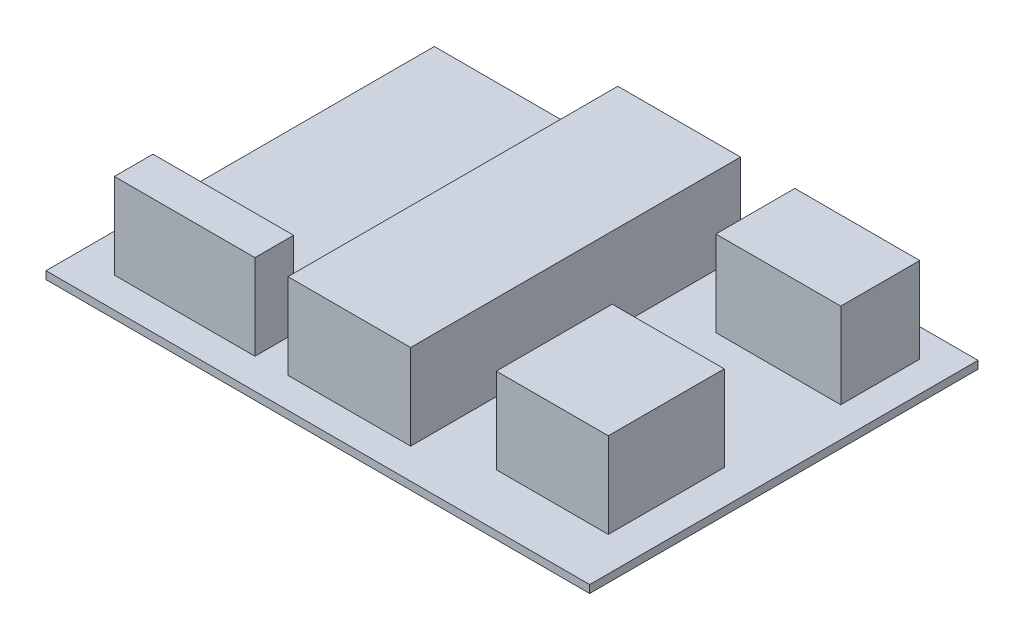
ISO-10303-21;
HEADER;
FILE_DESCRIPTION(('STEP AP214'),'2;1');
FILE_NAME('part.step','',(''),(''),'','','');
FILE_SCHEMA(('AUTOMOTIVE_DESIGN { 1 0 10303 214 1 1 1 1 }'));
ENDSEC;
DATA;
#1=APPLICATION_CONTEXT('core data for automotive mechanical design processes');
#2=APPLICATION_PROTOCOL_DEFINITION('international standard','automotive_design',2000,#1);
#3=PRODUCT_CONTEXT('',#1,'mechanical');
#4=PRODUCT('Part','Part','',(#3));
#5=PRODUCT_RELATED_PRODUCT_CATEGORY('part','',(#4));
#6=PRODUCT_DEFINITION_FORMATION('','',#4);
#7=PRODUCT_DEFINITION_CONTEXT('part definition',#1,'design');
#8=PRODUCT_DEFINITION('design','',#6,#7);
#9=PRODUCT_DEFINITION_SHAPE('','',#8);
#10=(LENGTH_UNIT() NAMED_UNIT(*) SI_UNIT(.MILLI.,.METRE.));
#11=(NAMED_UNIT(*) PLANE_ANGLE_UNIT() SI_UNIT($,.RADIAN.));
#12=(NAMED_UNIT(*) SI_UNIT($,.STERADIAN.) SOLID_ANGLE_UNIT());
#13=UNCERTAINTY_MEASURE_WITH_UNIT(LENGTH_MEASURE(1.E-05),#10,'distance_accuracy_value','');
#14=(GEOMETRIC_REPRESENTATION_CONTEXT(3) GLOBAL_UNCERTAINTY_ASSIGNED_CONTEXT((#13)) GLOBAL_UNIT_ASSIGNED_CONTEXT((#10,
#11,#12)) REPRESENTATION_CONTEXT('',''));
#15=CARTESIAN_POINT('',(0.,0.,0.));
#16=DIRECTION('',(0.,0.,1.));
#17=DIRECTION('',(1.,0.,0.));
#18=AXIS2_PLACEMENT_3D('',#15,#16,#17);
#19=CARTESIAN_POINT('',(0.,1.,0.));
#20=DIRECTION('',(0.,1.,0.));
#21=DIRECTION('',(0.,0.,1.));
#22=AXIS2_PLACEMENT_3D('',#19,#20,#21);
#23=PLANE('',#22);
#24=DIRECTION('',(0.,0.,1.));
#25=VECTOR('',#24,1.);
#26=CARTESIAN_POINT('',(-31.810551558753,1.,-37.6618705035971));
#27=LINE('',#26,#25);
#28=CARTESIAN_POINT('',(-31.810551558753,1.,-37.6618705035971));
#29=VERTEX_POINT('',#28);
#30=CARTESIAN_POINT('',(-31.810551558753,1.,12.3381294964029));
#31=VERTEX_POINT('',#30);
#32=EDGE_CURVE('E305',#29,#31,#27,.T.);
#33=ORIENTED_EDGE('',*,*,#32,.T.);
#34=DIRECTION('',(1.,0.,0.));
#35=VECTOR('',#34,1.);
#36=CARTESIAN_POINT('',(-31.810551558753,1.,12.3381294964029));
#37=LINE('',#36,#35);
#38=CARTESIAN_POINT('',(38.189448441247,1.,12.3381294964029));
#39=VERTEX_POINT('',#38);
#40=EDGE_CURVE('E308',#31,#39,#37,.T.);
#41=ORIENTED_EDGE('',*,*,#40,.T.);
#42=DIRECTION('',(0.,0.,-1.));
#43=VECTOR('',#42,1.);
#44=CARTESIAN_POINT('',(38.189448441247,1.,-37.6618705035971));
#45=LINE('',#44,#43);
#46=CARTESIAN_POINT('',(38.189448441247,1.,-37.6618705035971));
#47=VERTEX_POINT('',#46);
#48=EDGE_CURVE('E311',#39,#47,#45,.T.);
#49=ORIENTED_EDGE('',*,*,#48,.T.);
#50=DIRECTION('',(-1.,0.,0.));
#51=VECTOR('',#50,1.);
#52=CARTESIAN_POINT('',(-31.810551558753,1.,-37.6618705035971));
#53=LINE('',#52,#51);
#54=EDGE_CURVE('E313',#47,#29,#53,.T.);
#55=ORIENTED_EDGE('',*,*,#54,.T.);
#56=EDGE_LOOP('',(#33,#41,#49,#55));
#57=FACE_BOUND('',#56,.T.);
#58=DIRECTION('',(-1.,0.,0.));
#59=VECTOR('',#58,1.);
#60=CARTESIAN_POINT('',(0.,1.,8.43019669865698));
#61=LINE('',#60,#59);
#62=CARTESIAN_POINT('',(11.2296723491148,1.,8.43019669865698));
#63=VERTEX_POINT('',#62);
#64=CARTESIAN_POINT('',(-4.562336940778,1.,8.43019669865698));
#65=VERTEX_POINT('',#64);
#66=EDGE_CURVE('E298',#63,#65,#61,.T.);
#67=ORIENTED_EDGE('',*,*,#66,.T.);
#68=DIRECTION('',(0.,0.,-1.));
#69=VECTOR('',#68,1.);
#70=CARTESIAN_POINT('',(-4.562336940778,1.,0.));
#71=LINE('',#70,#69);
#72=CARTESIAN_POINT('',(-4.562336940778,1.,-34.042376231694));
#73=VERTEX_POINT('',#72);
#74=EDGE_CURVE('E301',#65,#73,#71,.T.);
#75=ORIENTED_EDGE('',*,*,#74,.T.);
#76=DIRECTION('',(1.,0.,0.));
#77=VECTOR('',#76,1.);
#78=CARTESIAN_POINT('',(0.,1.,-34.042376231694));
#79=LINE('',#78,#77);
#80=CARTESIAN_POINT('',(11.2296723491148,1.,-34.042376231694));
#81=VERTEX_POINT('',#80);
#82=EDGE_CURVE('E292',#73,#81,#79,.T.);
#83=ORIENTED_EDGE('',*,*,#82,.T.);
#84=DIRECTION('',(0.,0.,1.));
#85=VECTOR('',#84,1.);
#86=CARTESIAN_POINT('',(11.2296723491148,1.,0.));
#87=LINE('',#86,#85);
#88=EDGE_CURVE('E295',#81,#63,#87,.T.);
#89=ORIENTED_EDGE('',*,*,#88,.T.);
#90=EDGE_LOOP('',(#67,#75,#83,#89));
#91=FACE_BOUND('',#90,.T.);
#92=DIRECTION('',(-1.,0.,0.));
#93=VECTOR('',#92,1.);
#94=CARTESIAN_POINT('',(0.,1.,-23.8749181957356));
#95=LINE('',#94,#93);
#96=CARTESIAN_POINT('',(34.3047544165381,1.,-23.8749181957356));
#97=VERTEX_POINT('',#96);
#98=CARTESIAN_POINT('',(18.2243066008025,1.,-23.8749181957356));
#99=VERTEX_POINT('',#98);
#100=EDGE_CURVE('E266',#97,#99,#95,.T.);
#101=ORIENTED_EDGE('',*,*,#100,.T.);
#102=DIRECTION('',(0.,0.,-1.));
#103=VECTOR('',#102,1.);
#104=CARTESIAN_POINT('',(18.2243066008025,1.,0.));
#105=LINE('',#104,#103);
#106=CARTESIAN_POINT('',(18.2243066008025,1.,-34.042376231694));
#107=VERTEX_POINT('',#106);
#108=EDGE_CURVE('E269',#99,#107,#105,.T.);
#109=ORIENTED_EDGE('',*,*,#108,.T.);
#110=DIRECTION('',(1.,0.,0.));
#111=VECTOR('',#110,1.);
#112=CARTESIAN_POINT('',(0.,1.,-34.042376231694));
#113=LINE('',#112,#111);
#114=CARTESIAN_POINT('',(34.3047544165381,1.,-34.042376231694));
#115=VERTEX_POINT('',#114);
#116=EDGE_CURVE('E260',#107,#115,#113,.T.);
#117=ORIENTED_EDGE('',*,*,#116,.T.);
#118=DIRECTION('',(0.,0.,1.));
#119=VECTOR('',#118,1.);
#120=CARTESIAN_POINT('',(34.3047544165381,1.,0.));
#121=LINE('',#120,#119);
#122=EDGE_CURVE('E263',#115,#97,#121,.T.);
#123=ORIENTED_EDGE('',*,*,#122,.T.);
#124=EDGE_LOOP('',(#101,#109,#117,#123));
#125=FACE_BOUND('',#124,.T.);
#126=DIRECTION('',(-1.,0.,0.));
#127=VECTOR('',#126,1.);
#128=CARTESIAN_POINT('',(0.,1.,5.54581144022907));
#129=LINE('',#128,#127);
#130=CARTESIAN_POINT('',(33.7999869963132,1.,5.54581144022907));
#131=VERTEX_POINT('',#130);
#132=CARTESIAN_POINT('',(19.3780607041737,1.,5.54581144022907));
#133=VERTEX_POINT('',#132);
#134=EDGE_CURVE('E234',#131,#133,#129,.T.);
#135=ORIENTED_EDGE('',*,*,#134,.T.);
#136=DIRECTION('',(0.,0.,-1.));
#137=VECTOR('',#136,1.);
#138=CARTESIAN_POINT('',(19.3780607041737,1.,0.));
#139=LINE('',#138,#137);
#140=CARTESIAN_POINT('',(19.3780607041737,1.,-9.38088227213537));
#141=VERTEX_POINT('',#140);
#142=EDGE_CURVE('E237',#133,#141,#139,.T.);
#143=ORIENTED_EDGE('',*,*,#142,.T.);
#144=DIRECTION('',(1.,0.,0.));
#145=VECTOR('',#144,1.);
#146=CARTESIAN_POINT('',(0.,1.,-9.38088227213537));
#147=LINE('',#146,#145);
#148=CARTESIAN_POINT('',(33.7999869963132,1.,-9.38088227213537));
#149=VERTEX_POINT('',#148);
#150=EDGE_CURVE('E228',#141,#149,#147,.T.);
#151=ORIENTED_EDGE('',*,*,#150,.T.);
#152=DIRECTION('',(0.,0.,1.));
#153=VECTOR('',#152,1.);
#154=CARTESIAN_POINT('',(33.7999869963132,1.,0.));
#155=LINE('',#154,#153);
#156=EDGE_CURVE('E231',#149,#131,#155,.T.);
#157=ORIENTED_EDGE('',*,*,#156,.T.);
#158=EDGE_LOOP('',(#135,#143,#151,#157));
#159=FACE_BOUND('',#158,.T.);
#160=DIRECTION('',(-1.,0.,0.));
#161=VECTOR('',#160,1.);
#162=CARTESIAN_POINT('',(0.,1.,8.43019669865698));
#163=LINE('',#162,#161);
#164=CARTESIAN_POINT('',(-8.81680519695917,1.,8.43019669865698));
#165=VERTEX_POINT('',#164);
#166=CARTESIAN_POINT('',(-26.9163226935943,1.,8.43019669865698));
#167=VERTEX_POINT('',#166);
#168=EDGE_CURVE('E206',#165,#167,#163,.T.);
#169=ORIENTED_EDGE('',*,*,#168,.T.);
#170=DIRECTION('',(0.,0.,-1.));
#171=VECTOR('',#170,1.);
#172=CARTESIAN_POINT('',(-26.9163226935943,1.,0.));
#173=LINE('',#172,#171);
#174=CARTESIAN_POINT('',(-26.9163226935943,1.,3.45463212786884));
#175=VERTEX_POINT('',#174);
#176=EDGE_CURVE('E195',#167,#175,#173,.T.);
#177=ORIENTED_EDGE('',*,*,#176,.T.);
#178=DIRECTION('',(1.,0.,0.));
#179=VECTOR('',#178,1.);
#180=CARTESIAN_POINT('',(0.,1.,3.45463212786884));
#181=LINE('',#180,#179);
#182=CARTESIAN_POINT('',(-8.81680519695917,1.,3.45463212786884));
#183=VERTEX_POINT('',#182);
#184=EDGE_CURVE('E196',#175,#183,#181,.T.);
#185=ORIENTED_EDGE('',*,*,#184,.T.);
#186=DIRECTION('',(0.,0.,1.));
#187=VECTOR('',#186,1.);
#188=CARTESIAN_POINT('',(-8.81680519695917,1.,0.));
#189=LINE('',#188,#187);
#190=EDGE_CURVE('E199',#183,#165,#189,.T.);
#191=ORIENTED_EDGE('',*,*,#190,.T.);
#192=EDGE_LOOP('',(#169,#177,#185,#191));
#193=FACE_BOUND('',#192,.T.);
#194=ADVANCED_FACE('F34',(#57,#91,#125,#159,#193),#23,.T.);
#195=CARTESIAN_POINT('',(-31.810551558753,1.,-37.6618705035971));
#196=DIRECTION('',(1.,0.,0.));
#197=DIRECTION('',(0.,0.,-1.));
#198=AXIS2_PLACEMENT_3D('',#195,#196,#197);
#199=PLANE('',#198);
#200=DIRECTION('',(0.,0.,1.));
#201=VECTOR('',#200,1.);
#202=CARTESIAN_POINT('',(-31.810551558753,0.,-37.6618705035971));
#203=LINE('',#202,#201);
#204=CARTESIAN_POINT('',(-31.810551558753,0.,-37.6618705035971));
#205=VERTEX_POINT('',#204);
#206=CARTESIAN_POINT('',(-31.810551558753,0.,12.3381294964029));
#207=VERTEX_POINT('',#206);
#208=EDGE_CURVE('E304',#205,#207,#203,.T.);
#209=ORIENTED_EDGE('',*,*,#208,.T.);
#210=DIRECTION('',(0.,-1.,0.));
#211=VECTOR('',#210,1.);
#212=CARTESIAN_POINT('',(-31.810551558753,1.,12.3381294964029));
#213=LINE('',#212,#211);
#214=EDGE_CURVE('E11',#31,#207,#213,.T.);
#215=ORIENTED_EDGE('',*,*,#214,.F.);
#216=ORIENTED_EDGE('',*,*,#32,.F.);
#217=DIRECTION('',(0.,-1.,0.));
#218=VECTOR('',#217,1.);
#219=CARTESIAN_POINT('',(-31.810551558753,1.,-37.6618705035971));
#220=LINE('',#219,#218);
#221=EDGE_CURVE('E315',#29,#205,#220,.T.);
#222=ORIENTED_EDGE('',*,*,#221,.T.);
#223=EDGE_LOOP('',(#209,#215,#216,#222));
#224=FACE_BOUND('',#223,.T.);
#225=ADVANCED_FACE('F36',(#224),#199,.F.);
#226=CARTESIAN_POINT('',(-31.810551558753,1.,12.3381294964029));
#227=DIRECTION('',(0.,0.,-1.));
#228=DIRECTION('',(-1.,0.,0.));
#229=AXIS2_PLACEMENT_3D('',#226,#227,#228);
#230=PLANE('',#229);
#231=DIRECTION('',(1.,0.,0.));
#232=VECTOR('',#231,1.);
#233=CARTESIAN_POINT('',(-31.810551558753,0.,12.3381294964029));
#234=LINE('',#233,#232);
#235=CARTESIAN_POINT('',(38.189448441247,0.,12.3381294964029));
#236=VERTEX_POINT('',#235);
#237=EDGE_CURVE('E318',#207,#236,#234,.T.);
#238=ORIENTED_EDGE('',*,*,#237,.T.);
#239=DIRECTION('',(0.,-1.,0.));
#240=VECTOR('',#239,1.);
#241=CARTESIAN_POINT('',(38.189448441247,1.,12.3381294964029));
#242=LINE('',#241,#240);
#243=EDGE_CURVE('E42',#39,#236,#242,.T.);
#244=ORIENTED_EDGE('',*,*,#243,.F.);
#245=ORIENTED_EDGE('',*,*,#40,.F.);
#246=ORIENTED_EDGE('',*,*,#214,.T.);
#247=EDGE_LOOP('',(#238,#244,#245,#246));
#248=FACE_BOUND('',#247,.T.);
#249=ADVANCED_FACE('F348',(#248),#230,.F.);
#250=CARTESIAN_POINT('',(38.189448441247,1.,-37.6618705035971));
#251=DIRECTION('',(-1.,0.,0.));
#252=DIRECTION('',(0.,0.,1.));
#253=AXIS2_PLACEMENT_3D('',#250,#251,#252);
#254=PLANE('',#253);
#255=DIRECTION('',(0.,0.,-1.));
#256=VECTOR('',#255,1.);
#257=CARTESIAN_POINT('',(38.189448441247,0.,-37.6618705035971));
#258=LINE('',#257,#256);
#259=CARTESIAN_POINT('',(38.189448441247,0.,-37.6618705035971));
#260=VERTEX_POINT('',#259);
#261=EDGE_CURVE('E320',#236,#260,#258,.T.);
#262=ORIENTED_EDGE('',*,*,#261,.T.);
#263=DIRECTION('',(0.,-1.,0.));
#264=VECTOR('',#263,1.);
#265=CARTESIAN_POINT('',(38.189448441247,1.,-37.6618705035971));
#266=LINE('',#265,#264);
#267=EDGE_CURVE('E325',#47,#260,#266,.T.);
#268=ORIENTED_EDGE('',*,*,#267,.F.);
#269=ORIENTED_EDGE('',*,*,#48,.F.);
#270=ORIENTED_EDGE('',*,*,#243,.T.);
#271=EDGE_LOOP('',(#262,#268,#269,#270));
#272=FACE_BOUND('',#271,.T.);
#273=ADVANCED_FACE('F332',(#272),#254,.F.);
#274=CARTESIAN_POINT('',(-31.810551558753,1.,-37.6618705035971));
#275=DIRECTION('',(0.,0.,1.));
#276=DIRECTION('',(1.,0.,0.));
#277=AXIS2_PLACEMENT_3D('',#274,#275,#276);
#278=PLANE('',#277);
#279=DIRECTION('',(-1.,0.,0.));
#280=VECTOR('',#279,1.);
#281=CARTESIAN_POINT('',(-31.810551558753,0.,-37.6618705035971));
#282=LINE('',#281,#280);
#283=EDGE_CURVE('E309',#260,#205,#282,.T.);
#284=ORIENTED_EDGE('',*,*,#283,.T.);
#285=ORIENTED_EDGE('',*,*,#221,.F.);
#286=ORIENTED_EDGE('',*,*,#54,.F.);
#287=ORIENTED_EDGE('',*,*,#267,.T.);
#288=EDGE_LOOP('',(#284,#285,#286,#287));
#289=FACE_BOUND('',#288,.T.);
#290=ADVANCED_FACE('F341',(#289),#278,.F.);
#291=CARTESIAN_POINT('',(0.,0.,0.));
#292=DIRECTION('',(0.,1.,0.));
#293=DIRECTION('',(0.,0.,1.));
#294=AXIS2_PLACEMENT_3D('',#291,#292,#293);
#295=PLANE('',#294);
#296=ORIENTED_EDGE('',*,*,#208,.F.);
#297=ORIENTED_EDGE('',*,*,#283,.F.);
#298=ORIENTED_EDGE('',*,*,#261,.F.);
#299=ORIENTED_EDGE('',*,*,#237,.F.);
#300=EDGE_LOOP('',(#296,#297,#298,#299));
#301=FACE_BOUND('',#300,.T.);
#302=ADVANCED_FACE('F338',(#301),#295,.F.);
#303=CARTESIAN_POINT('',(-4.562336940778,12.,-34.042376231694));
#304=DIRECTION('',(1.,0.,0.));
#305=DIRECTION('',(0.,0.,-1.));
#306=AXIS2_PLACEMENT_3D('',#303,#304,#305);
#307=PLANE('',#306);
#308=ORIENTED_EDGE('',*,*,#74,.F.);
#309=DIRECTION('',(0.,-1.,0.));
#310=VECTOR('',#309,1.);
#311=CARTESIAN_POINT('',(-4.562336940778,12.,8.43019669865698));
#312=LINE('',#311,#310);
#313=CARTESIAN_POINT('',(-4.562336940778,12.,8.43019669865698));
#314=VERTEX_POINT('',#313);
#315=EDGE_CURVE('E289',#314,#65,#312,.T.);
#316=ORIENTED_EDGE('',*,*,#315,.F.);
#317=DIRECTION('',(0.,0.,1.));
#318=VECTOR('',#317,1.);
#319=CARTESIAN_POINT('',(-4.562336940778,12.,-34.042376231694));
#320=LINE('',#319,#318);
#321=CARTESIAN_POINT('',(-4.562336940778,12.,-34.042376231694));
#322=VERTEX_POINT('',#321);
#323=EDGE_CURVE('E272',#322,#314,#320,.T.);
#324=ORIENTED_EDGE('',*,*,#323,.F.);
#325=DIRECTION('',(0.,-1.,0.));
#326=VECTOR('',#325,1.);
#327=CARTESIAN_POINT('',(-4.562336940778,12.,-34.042376231694));
#328=LINE('',#327,#326);
#329=EDGE_CURVE('E281',#322,#73,#328,.T.);
#330=ORIENTED_EDGE('',*,*,#329,.T.);
#331=EDGE_LOOP('',(#308,#316,#324,#330));
#332=FACE_BOUND('',#331,.T.);
#333=ADVANCED_FACE('F361',(#332),#307,.F.);
#334=CARTESIAN_POINT('',(-4.562336940778,12.,8.43019669865698));
#335=DIRECTION('',(0.,0.,-1.));
#336=DIRECTION('',(-1.,0.,0.));
#337=AXIS2_PLACEMENT_3D('',#334,#335,#336);
#338=PLANE('',#337);
#339=ORIENTED_EDGE('',*,*,#66,.F.);
#340=DIRECTION('',(0.,-1.,0.));
#341=VECTOR('',#340,1.);
#342=CARTESIAN_POINT('',(11.2296723491148,12.,8.43019669865698));
#343=LINE('',#342,#341);
#344=CARTESIAN_POINT('',(11.2296723491148,12.,8.43019669865698));
#345=VERTEX_POINT('',#344);
#346=EDGE_CURVE('E286',#345,#63,#343,.T.);
#347=ORIENTED_EDGE('',*,*,#346,.F.);
#348=DIRECTION('',(1.,0.,0.));
#349=VECTOR('',#348,1.);
#350=CARTESIAN_POINT('',(-4.562336940778,12.,8.43019669865698));
#351=LINE('',#350,#349);
#352=EDGE_CURVE('E275',#314,#345,#351,.T.);
#353=ORIENTED_EDGE('',*,*,#352,.F.);
#354=ORIENTED_EDGE('',*,*,#315,.T.);
#355=EDGE_LOOP('',(#339,#347,#353,#354));
#356=FACE_BOUND('',#355,.T.);
#357=ADVANCED_FACE('F380',(#356),#338,.F.);
#358=CARTESIAN_POINT('',(11.2296723491148,12.,-34.042376231694));
#359=DIRECTION('',(-1.,0.,0.));
#360=DIRECTION('',(0.,0.,1.));
#361=AXIS2_PLACEMENT_3D('',#358,#359,#360);
#362=PLANE('',#361);
#363=ORIENTED_EDGE('',*,*,#88,.F.);
#364=DIRECTION('',(0.,-1.,0.));
#365=VECTOR('',#364,1.);
#366=CARTESIAN_POINT('',(11.2296723491148,12.,-34.042376231694));
#367=LINE('',#366,#365);
#368=CARTESIAN_POINT('',(11.2296723491148,12.,-34.042376231694));
#369=VERTEX_POINT('',#368);
#370=EDGE_CURVE('E284',#369,#81,#367,.T.);
#371=ORIENTED_EDGE('',*,*,#370,.F.);
#372=DIRECTION('',(0.,0.,-1.));
#373=VECTOR('',#372,1.);
#374=CARTESIAN_POINT('',(11.2296723491148,12.,-34.042376231694));
#375=LINE('',#374,#373);
#376=EDGE_CURVE('E277',#345,#369,#375,.T.);
#377=ORIENTED_EDGE('',*,*,#376,.F.);
#378=ORIENTED_EDGE('',*,*,#346,.T.);
#379=EDGE_LOOP('',(#363,#371,#377,#378));
#380=FACE_BOUND('',#379,.T.);
#381=ADVANCED_FACE('F387',(#380),#362,.F.);
#382=CARTESIAN_POINT('',(-4.562336940778,12.,-34.042376231694));
#383=DIRECTION('',(0.,0.,1.));
#384=DIRECTION('',(1.,0.,0.));
#385=AXIS2_PLACEMENT_3D('',#382,#383,#384);
#386=PLANE('',#385);
#387=ORIENTED_EDGE('',*,*,#82,.F.);
#388=ORIENTED_EDGE('',*,*,#329,.F.);
#389=DIRECTION('',(-1.,0.,0.));
#390=VECTOR('',#389,1.);
#391=CARTESIAN_POINT('',(-4.562336940778,12.,-34.042376231694));
#392=LINE('',#391,#390);
#393=EDGE_CURVE('E279',#369,#322,#392,.T.);
#394=ORIENTED_EDGE('',*,*,#393,.F.);
#395=ORIENTED_EDGE('',*,*,#370,.T.);
#396=EDGE_LOOP('',(#387,#388,#394,#395));
#397=FACE_BOUND('',#396,.T.);
#398=ADVANCED_FACE('F394',(#397),#386,.F.);
#399=CARTESIAN_POINT('',(0.,12.,0.));
#400=DIRECTION('',(0.,1.,0.));
#401=DIRECTION('',(0.,0.,1.));
#402=AXIS2_PLACEMENT_3D('',#399,#400,#401);
#403=PLANE('',#402);
#404=ORIENTED_EDGE('',*,*,#323,.T.);
#405=ORIENTED_EDGE('',*,*,#352,.T.);
#406=ORIENTED_EDGE('',*,*,#376,.T.);
#407=ORIENTED_EDGE('',*,*,#393,.T.);
#408=EDGE_LOOP('',(#404,#405,#406,#407));
#409=FACE_BOUND('',#408,.T.);
#410=ADVANCED_FACE('F402',(#409),#403,.T.);
#411=CARTESIAN_POINT('',(18.2243066008025,12.,-34.042376231694));
#412=DIRECTION('',(1.,0.,0.));
#413=DIRECTION('',(0.,0.,-1.));
#414=AXIS2_PLACEMENT_3D('',#411,#412,#413);
#415=PLANE('',#414);
#416=ORIENTED_EDGE('',*,*,#108,.F.);
#417=DIRECTION('',(0.,-1.,0.));
#418=VECTOR('',#417,1.);
#419=CARTESIAN_POINT('',(18.2243066008025,12.,-23.8749181957356));
#420=LINE('',#419,#418);
#421=CARTESIAN_POINT('',(18.2243066008025,12.,-23.8749181957356));
#422=VERTEX_POINT('',#421);
#423=EDGE_CURVE('E257',#422,#99,#420,.T.);
#424=ORIENTED_EDGE('',*,*,#423,.F.);
#425=DIRECTION('',(0.,0.,1.));
#426=VECTOR('',#425,1.);
#427=CARTESIAN_POINT('',(18.2243066008025,12.,-34.042376231694));
#428=LINE('',#427,#426);
#429=CARTESIAN_POINT('',(18.2243066008025,12.,-34.042376231694));
#430=VERTEX_POINT('',#429);
#431=EDGE_CURVE('E240',#430,#422,#428,.T.);
#432=ORIENTED_EDGE('',*,*,#431,.F.);
#433=DIRECTION('',(0.,-1.,0.));
#434=VECTOR('',#433,1.);
#435=CARTESIAN_POINT('',(18.2243066008025,12.,-34.042376231694));
#436=LINE('',#435,#434);
#437=EDGE_CURVE('E249',#430,#107,#436,.T.);
#438=ORIENTED_EDGE('',*,*,#437,.T.);
#439=EDGE_LOOP('',(#416,#424,#432,#438));
#440=FACE_BOUND('',#439,.T.);
#441=ADVANCED_FACE('F411',(#440),#415,.F.);
#442=CARTESIAN_POINT('',(18.2243066008025,12.,-23.8749181957356));
#443=DIRECTION('',(0.,0.,-1.));
#444=DIRECTION('',(-1.,0.,0.));
#445=AXIS2_PLACEMENT_3D('',#442,#443,#444);
#446=PLANE('',#445);
#447=ORIENTED_EDGE('',*,*,#100,.F.);
#448=DIRECTION('',(0.,-1.,0.));
#449=VECTOR('',#448,1.);
#450=CARTESIAN_POINT('',(34.3047544165381,12.,-23.8749181957356));
#451=LINE('',#450,#449);
#452=CARTESIAN_POINT('',(34.3047544165381,12.,-23.8749181957356));
#453=VERTEX_POINT('',#452);
#454=EDGE_CURVE('E254',#453,#97,#451,.T.);
#455=ORIENTED_EDGE('',*,*,#454,.F.);
#456=DIRECTION('',(1.,0.,0.));
#457=VECTOR('',#456,1.);
#458=CARTESIAN_POINT('',(18.2243066008025,12.,-23.8749181957356));
#459=LINE('',#458,#457);
#460=EDGE_CURVE('E243',#422,#453,#459,.T.);
#461=ORIENTED_EDGE('',*,*,#460,.F.);
#462=ORIENTED_EDGE('',*,*,#423,.T.);
#463=EDGE_LOOP('',(#447,#455,#461,#462));
#464=FACE_BOUND('',#463,.T.);
#465=ADVANCED_FACE('F419',(#464),#446,.F.);
#466=CARTESIAN_POINT('',(34.3047544165381,12.,-34.042376231694));
#467=DIRECTION('',(-1.,0.,0.));
#468=DIRECTION('',(0.,0.,1.));
#469=AXIS2_PLACEMENT_3D('',#466,#467,#468);
#470=PLANE('',#469);
#471=ORIENTED_EDGE('',*,*,#122,.F.);
#472=DIRECTION('',(0.,-1.,0.));
#473=VECTOR('',#472,1.);
#474=CARTESIAN_POINT('',(34.3047544165381,12.,-34.042376231694));
#475=LINE('',#474,#473);
#476=CARTESIAN_POINT('',(34.3047544165381,12.,-34.042376231694));
#477=VERTEX_POINT('',#476);
#478=EDGE_CURVE('E252',#477,#115,#475,.T.);
#479=ORIENTED_EDGE('',*,*,#478,.F.);
#480=DIRECTION('',(0.,0.,-1.));
#481=VECTOR('',#480,1.);
#482=CARTESIAN_POINT('',(34.3047544165381,12.,-34.042376231694));
#483=LINE('',#482,#481);
#484=EDGE_CURVE('E245',#453,#477,#483,.T.);
#485=ORIENTED_EDGE('',*,*,#484,.F.);
#486=ORIENTED_EDGE('',*,*,#454,.T.);
#487=EDGE_LOOP('',(#471,#479,#485,#486));
#488=FACE_BOUND('',#487,.T.);
#489=ADVANCED_FACE('F427',(#488),#470,.F.);
#490=CARTESIAN_POINT('',(18.2243066008025,12.,-34.042376231694));
#491=DIRECTION('',(0.,0.,1.));
#492=DIRECTION('',(1.,0.,0.));
#493=AXIS2_PLACEMENT_3D('',#490,#491,#492);
#494=PLANE('',#493);
#495=ORIENTED_EDGE('',*,*,#116,.F.);
#496=ORIENTED_EDGE('',*,*,#437,.F.);
#497=DIRECTION('',(-1.,0.,0.));
#498=VECTOR('',#497,1.);
#499=CARTESIAN_POINT('',(18.2243066008025,12.,-34.042376231694));
#500=LINE('',#499,#498);
#501=EDGE_CURVE('E247',#477,#430,#500,.T.);
#502=ORIENTED_EDGE('',*,*,#501,.F.);
#503=ORIENTED_EDGE('',*,*,#478,.T.);
#504=EDGE_LOOP('',(#495,#496,#502,#503));
#505=FACE_BOUND('',#504,.T.);
#506=ADVANCED_FACE('F435',(#505),#494,.F.);
#507=CARTESIAN_POINT('',(0.,12.,0.));
#508=DIRECTION('',(0.,1.,0.));
#509=DIRECTION('',(0.,0.,1.));
#510=AXIS2_PLACEMENT_3D('',#507,#508,#509);
#511=PLANE('',#510);
#512=ORIENTED_EDGE('',*,*,#431,.T.);
#513=ORIENTED_EDGE('',*,*,#460,.T.);
#514=ORIENTED_EDGE('',*,*,#484,.T.);
#515=ORIENTED_EDGE('',*,*,#501,.T.);
#516=EDGE_LOOP('',(#512,#513,#514,#515));
#517=FACE_BOUND('',#516,.T.);
#518=ADVANCED_FACE('F443',(#517),#511,.T.);
#519=CARTESIAN_POINT('',(19.3780607041737,12.,-9.38088227213537));
#520=DIRECTION('',(1.,0.,0.));
#521=DIRECTION('',(0.,0.,-1.));
#522=AXIS2_PLACEMENT_3D('',#519,#520,#521);
#523=PLANE('',#522);
#524=ORIENTED_EDGE('',*,*,#142,.F.);
#525=DIRECTION('',(0.,-1.,0.));
#526=VECTOR('',#525,1.);
#527=CARTESIAN_POINT('',(19.3780607041737,12.,5.54581144022907));
#528=LINE('',#527,#526);
#529=CARTESIAN_POINT('',(19.3780607041737,12.,5.54581144022907));
#530=VERTEX_POINT('',#529);
#531=EDGE_CURVE('E225',#530,#133,#528,.T.);
#532=ORIENTED_EDGE('',*,*,#531,.F.);
#533=DIRECTION('',(0.,0.,1.));
#534=VECTOR('',#533,1.);
#535=CARTESIAN_POINT('',(19.3780607041737,12.,-9.38088227213537));
#536=LINE('',#535,#534);
#537=CARTESIAN_POINT('',(19.3780607041737,12.,-9.38088227213537));
#538=VERTEX_POINT('',#537);
#539=EDGE_CURVE('E209',#538,#530,#536,.T.);
#540=ORIENTED_EDGE('',*,*,#539,.F.);
#541=DIRECTION('',(0.,-1.,0.));
#542=VECTOR('',#541,1.);
#543=CARTESIAN_POINT('',(19.3780607041737,12.,-9.38088227213537));
#544=LINE('',#543,#542);
#545=EDGE_CURVE('E218',#538,#141,#544,.T.);
#546=ORIENTED_EDGE('',*,*,#545,.T.);
#547=EDGE_LOOP('',(#524,#532,#540,#546));
#548=FACE_BOUND('',#547,.T.);
#549=ADVANCED_FACE('F452',(#548),#523,.F.);
#550=CARTESIAN_POINT('',(19.3780607041737,12.,5.54581144022907));
#551=DIRECTION('',(0.,0.,-1.));
#552=DIRECTION('',(-1.,0.,0.));
#553=AXIS2_PLACEMENT_3D('',#550,#551,#552);
#554=PLANE('',#553);
#555=ORIENTED_EDGE('',*,*,#134,.F.);
#556=DIRECTION('',(0.,-1.,0.));
#557=VECTOR('',#556,1.);
#558=CARTESIAN_POINT('',(33.7999869963132,12.,5.54581144022907));
#559=LINE('',#558,#557);
#560=CARTESIAN_POINT('',(33.7999869963132,12.,5.54581144022907));
#561=VERTEX_POINT('',#560);
#562=EDGE_CURVE('E222',#561,#131,#559,.T.);
#563=ORIENTED_EDGE('',*,*,#562,.F.);
#564=DIRECTION('',(1.,0.,0.));
#565=VECTOR('',#564,1.);
#566=CARTESIAN_POINT('',(19.3780607041737,12.,5.54581144022907));
#567=LINE('',#566,#565);
#568=EDGE_CURVE('E212',#530,#561,#567,.T.);
#569=ORIENTED_EDGE('',*,*,#568,.F.);
#570=ORIENTED_EDGE('',*,*,#531,.T.);
#571=EDGE_LOOP('',(#555,#563,#569,#570));
#572=FACE_BOUND('',#571,.T.);
#573=ADVANCED_FACE('F460',(#572),#554,.F.);
#574=CARTESIAN_POINT('',(33.7999869963132,12.,-9.38088227213537));
#575=DIRECTION('',(-1.,0.,0.));
#576=DIRECTION('',(0.,0.,1.));
#577=AXIS2_PLACEMENT_3D('',#574,#575,#576);
#578=PLANE('',#577);
#579=ORIENTED_EDGE('',*,*,#156,.F.);
#580=DIRECTION('',(0.,-1.,0.));
#581=VECTOR('',#580,1.);
#582=CARTESIAN_POINT('',(33.7999869963132,12.,-9.38088227213537));
#583=LINE('',#582,#581);
#584=CARTESIAN_POINT('',(33.7999869963132,12.,-9.38088227213537));
#585=VERTEX_POINT('',#584);
#586=EDGE_CURVE('E57',#585,#149,#583,.T.);
#587=ORIENTED_EDGE('',*,*,#586,.F.);
#588=DIRECTION('',(0.,0.,-1.));
#589=VECTOR('',#588,1.);
#590=CARTESIAN_POINT('',(33.7999869963132,12.,-9.38088227213537));
#591=LINE('',#590,#589);
#592=EDGE_CURVE('E214',#561,#585,#591,.T.);
#593=ORIENTED_EDGE('',*,*,#592,.F.);
#594=ORIENTED_EDGE('',*,*,#562,.T.);
#595=EDGE_LOOP('',(#579,#587,#593,#594));
#596=FACE_BOUND('',#595,.T.);
#597=ADVANCED_FACE('F468',(#596),#578,.F.);
#598=CARTESIAN_POINT('',(19.3780607041737,12.,-9.38088227213537));
#599=DIRECTION('',(0.,0.,1.));
#600=DIRECTION('',(1.,0.,0.));
#601=AXIS2_PLACEMENT_3D('',#598,#599,#600);
#602=PLANE('',#601);
#603=ORIENTED_EDGE('',*,*,#150,.F.);
#604=ORIENTED_EDGE('',*,*,#545,.F.);
#605=DIRECTION('',(-1.,0.,0.));
#606=VECTOR('',#605,1.);
#607=CARTESIAN_POINT('',(19.3780607041737,12.,-9.38088227213537));
#608=LINE('',#607,#606);
#609=EDGE_CURVE('E216',#585,#538,#608,.T.);
#610=ORIENTED_EDGE('',*,*,#609,.F.);
#611=ORIENTED_EDGE('',*,*,#586,.T.);
#612=EDGE_LOOP('',(#603,#604,#610,#611));
#613=FACE_BOUND('',#612,.T.);
#614=ADVANCED_FACE('F476',(#613),#602,.F.);
#615=CARTESIAN_POINT('',(0.,12.,0.));
#616=DIRECTION('',(0.,1.,0.));
#617=DIRECTION('',(0.,0.,1.));
#618=AXIS2_PLACEMENT_3D('',#615,#616,#617);
#619=PLANE('',#618);
#620=ORIENTED_EDGE('',*,*,#539,.T.);
#621=ORIENTED_EDGE('',*,*,#568,.T.);
#622=ORIENTED_EDGE('',*,*,#592,.T.);
#623=ORIENTED_EDGE('',*,*,#609,.T.);
#624=EDGE_LOOP('',(#620,#621,#622,#623));
#625=FACE_BOUND('',#624,.T.);
#626=ADVANCED_FACE('F484',(#625),#619,.T.);
#627=CARTESIAN_POINT('',(-26.9163226935943,12.,8.43019669865698));
#628=DIRECTION('',(1.,0.,0.));
#629=DIRECTION('',(0.,0.,-1.));
#630=AXIS2_PLACEMENT_3D('',#627,#628,#629);
#631=PLANE('',#630);
#632=ORIENTED_EDGE('',*,*,#176,.F.);
#633=DIRECTION('',(0.,-1.,0.));
#634=VECTOR('',#633,1.);
#635=CARTESIAN_POINT('',(-26.9163226935943,12.,8.43019669865698));
#636=LINE('',#635,#634);
#637=CARTESIAN_POINT('',(-26.9163226935943,12.,8.43019669865698));
#638=VERTEX_POINT('',#637);
#639=EDGE_CURVE('E177',#638,#167,#636,.T.);
#640=ORIENTED_EDGE('',*,*,#639,.F.);
#641=DIRECTION('',(0.,0.,1.));
#642=VECTOR('',#641,1.);
#643=CARTESIAN_POINT('',(-26.9163226935943,12.,8.43019669865698));
#644=LINE('',#643,#642);
#645=CARTESIAN_POINT('',(-26.9163226935943,12.,3.45463212786884));
#646=VERTEX_POINT('',#645);
#647=EDGE_CURVE('E184',#646,#638,#644,.T.);
#648=ORIENTED_EDGE('',*,*,#647,.F.);
#649=DIRECTION('',(0.,-1.,0.));
#650=VECTOR('',#649,1.);
#651=CARTESIAN_POINT('',(-26.9163226935943,12.,3.45463212786884));
#652=LINE('',#651,#650);
#653=EDGE_CURVE('E639',#646,#175,#652,.T.);
#654=ORIENTED_EDGE('',*,*,#653,.T.);
#655=EDGE_LOOP('',(#632,#640,#648,#654));
#656=FACE_BOUND('',#655,.T.);
#657=ADVANCED_FACE('F193',(#656),#631,.F.);
#658=CARTESIAN_POINT('',(-26.9163226935943,12.,8.43019669865698));
#659=DIRECTION('',(0.,0.,-1.));
#660=DIRECTION('',(-1.,0.,0.));
#661=AXIS2_PLACEMENT_3D('',#658,#659,#660);
#662=PLANE('',#661);
#663=ORIENTED_EDGE('',*,*,#168,.F.);
#664=DIRECTION('',(0.,-1.,0.));
#665=VECTOR('',#664,1.);
#666=CARTESIAN_POINT('',(-8.81680519695917,12.,8.43019669865698));
#667=LINE('',#666,#665);
#668=CARTESIAN_POINT('',(-8.81680519695917,12.,8.43019669865698));
#669=VERTEX_POINT('',#668);
#670=EDGE_CURVE('E180',#669,#165,#667,.T.);
#671=ORIENTED_EDGE('',*,*,#670,.F.);
#672=DIRECTION('',(1.,0.,0.));
#673=VECTOR('',#672,1.);
#674=CARTESIAN_POINT('',(-26.9163226935943,12.,8.43019669865698));
#675=LINE('',#674,#673);
#676=EDGE_CURVE('E173',#638,#669,#675,.T.);
#677=ORIENTED_EDGE('',*,*,#676,.F.);
#678=ORIENTED_EDGE('',*,*,#639,.T.);
#679=EDGE_LOOP('',(#663,#671,#677,#678));
#680=FACE_BOUND('',#679,.T.);
#681=ADVANCED_FACE('F175',(#680),#662,.F.);
#682=CARTESIAN_POINT('',(-8.81680519695917,12.,8.43019669865698));
#683=DIRECTION('',(-1.,0.,0.));
#684=DIRECTION('',(0.,0.,1.));
#685=AXIS2_PLACEMENT_3D('',#682,#683,#684);
#686=PLANE('',#685);
#687=ORIENTED_EDGE('',*,*,#190,.F.);
#688=DIRECTION('',(0.,-1.,0.));
#689=VECTOR('',#688,1.);
#690=CARTESIAN_POINT('',(-8.81680519695917,12.,3.45463212786884));
#691=LINE('',#690,#689);
#692=CARTESIAN_POINT('',(-8.81680519695917,12.,3.45463212786884));
#693=VERTEX_POINT('',#692);
#694=EDGE_CURVE('E49',#693,#183,#691,.T.);
#695=ORIENTED_EDGE('',*,*,#694,.F.);
#696=DIRECTION('',(0.,0.,-1.));
#697=VECTOR('',#696,1.);
#698=CARTESIAN_POINT('',(-8.81680519695917,12.,8.43019669865698));
#699=LINE('',#698,#697);
#700=EDGE_CURVE('E183',#669,#693,#699,.T.);
#701=ORIENTED_EDGE('',*,*,#700,.F.);
#702=ORIENTED_EDGE('',*,*,#670,.T.);
#703=EDGE_LOOP('',(#687,#695,#701,#702));
#704=FACE_BOUND('',#703,.T.);
#705=ADVANCED_FACE('F503',(#704),#686,.F.);
#706=CARTESIAN_POINT('',(-26.9163226935943,12.,3.45463212786884));
#707=DIRECTION('',(0.,0.,1.));
#708=DIRECTION('',(1.,0.,0.));
#709=AXIS2_PLACEMENT_3D('',#706,#707,#708);
#710=PLANE('',#709);
#711=ORIENTED_EDGE('',*,*,#184,.F.);
#712=ORIENTED_EDGE('',*,*,#653,.F.);
#713=DIRECTION('',(-1.,0.,0.));
#714=VECTOR('',#713,1.);
#715=CARTESIAN_POINT('',(-26.9163226935943,12.,3.45463212786884));
#716=LINE('',#715,#714);
#717=EDGE_CURVE('E188',#693,#646,#716,.T.);
#718=ORIENTED_EDGE('',*,*,#717,.F.);
#719=ORIENTED_EDGE('',*,*,#694,.T.);
#720=EDGE_LOOP('',(#711,#712,#718,#719));
#721=FACE_BOUND('',#720,.T.);
#722=ADVANCED_FACE('F510',(#721),#710,.F.);
#723=CARTESIAN_POINT('',(0.,12.,0.));
#724=DIRECTION('',(0.,-1.,0.));
#725=DIRECTION('',(0.,0.,-1.));
#726=AXIS2_PLACEMENT_3D('',#723,#724,#725);
#727=PLANE('',#726);
#728=ORIENTED_EDGE('',*,*,#647,.T.);
#729=ORIENTED_EDGE('',*,*,#676,.T.);
#730=ORIENTED_EDGE('',*,*,#700,.T.);
#731=ORIENTED_EDGE('',*,*,#717,.T.);
#732=EDGE_LOOP('',(#728,#729,#730,#731));
#733=FACE_BOUND('',#732,.T.);
#734=ADVANCED_FACE('F187',(#733),#727,.F.);
#735=CLOSED_SHELL('',(#194,#225,#249,#273,#290,#302,#333,#357,#381,#398,#410,#441,#465,#489,
#506,#518,#549,#573,#597,#614,#626,#657,#681,#705,#722,#734));
#736=MANIFOLD_SOLID_BREP('B2',#735);
#737=ADVANCED_BREP_SHAPE_REPRESENTATION('',(#18,#736),#14);
#738=SHAPE_DEFINITION_REPRESENTATION(#9,#737);
ENDSEC;
END-ISO-10303-21;
